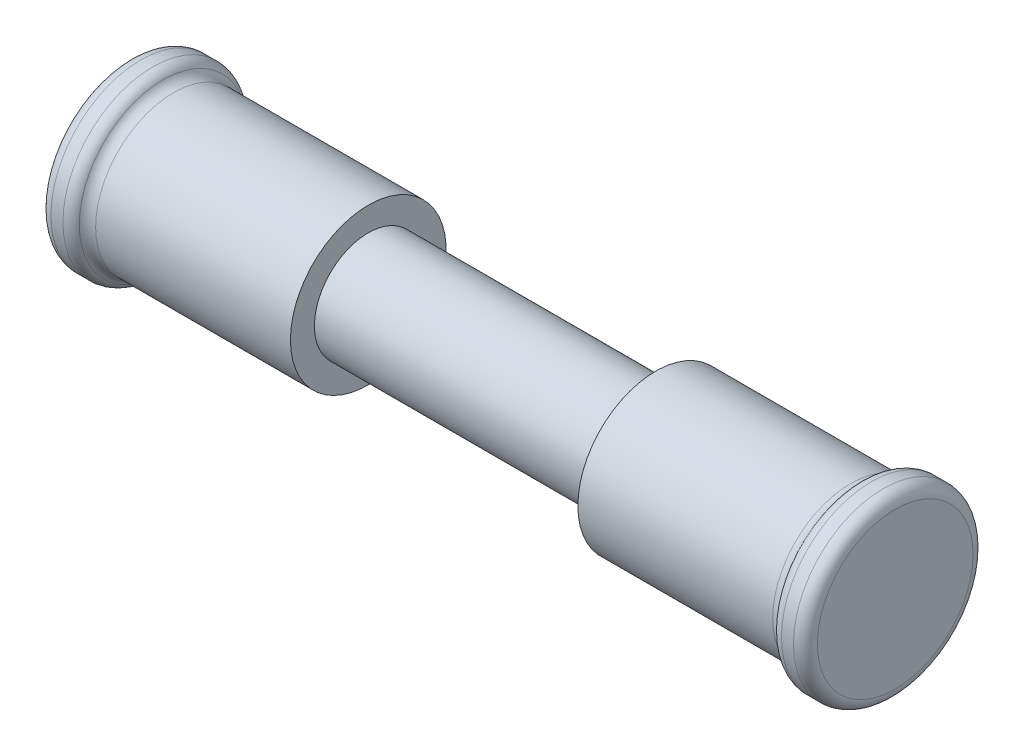
ISO-10303-21;
HEADER;
FILE_DESCRIPTION(('STEP AP214'),'2;1');
FILE_NAME('part.step','',(''),(''),'','','');
FILE_SCHEMA(('AUTOMOTIVE_DESIGN { 1 0 10303 214 1 1 1 1 }'));
ENDSEC;
DATA;
#1=APPLICATION_CONTEXT('core data for automotive mechanical design processes');
#2=APPLICATION_PROTOCOL_DEFINITION('international standard','automotive_design',2000,#1);
#3=PRODUCT_CONTEXT('',#1,'mechanical');
#4=PRODUCT('Part','Part','',(#3));
#5=PRODUCT_RELATED_PRODUCT_CATEGORY('part','',(#4));
#6=PRODUCT_DEFINITION_FORMATION('','',#4);
#7=PRODUCT_DEFINITION_CONTEXT('part definition',#1,'design');
#8=PRODUCT_DEFINITION('design','',#6,#7);
#9=PRODUCT_DEFINITION_SHAPE('','',#8);
#10=(LENGTH_UNIT() NAMED_UNIT(*) SI_UNIT(.MILLI.,.METRE.));
#11=(NAMED_UNIT(*) PLANE_ANGLE_UNIT() SI_UNIT($,.RADIAN.));
#12=(NAMED_UNIT(*) SI_UNIT($,.STERADIAN.) SOLID_ANGLE_UNIT());
#13=UNCERTAINTY_MEASURE_WITH_UNIT(LENGTH_MEASURE(1.E-05),#10,'distance_accuracy_value','');
#14=(GEOMETRIC_REPRESENTATION_CONTEXT(3) GLOBAL_UNCERTAINTY_ASSIGNED_CONTEXT((#13)) GLOBAL_UNIT_ASSIGNED_CONTEXT((#10,
#11,#12)) REPRESENTATION_CONTEXT('',''));
#15=CARTESIAN_POINT('',(0.,0.,0.));
#16=DIRECTION('',(0.,0.,1.));
#17=DIRECTION('',(1.,0.,0.));
#18=AXIS2_PLACEMENT_3D('',#15,#16,#17);
#19=CARTESIAN_POINT('',(16.,0.,0.));
#20=DIRECTION('',(-1.,0.,0.));
#21=DIRECTION('',(0.,0.,1.));
#22=AXIS2_PLACEMENT_3D('',#19,#20,#21);
#23=CYLINDRICAL_SURFACE('',#22,3.25);
#24=CARTESIAN_POINT('',(14.1339745962153,0.,0.));
#25=DIRECTION('',(-1.,0.,0.));
#26=DIRECTION('',(0.,0.,1.));
#27=AXIS2_PLACEMENT_3D('',#24,#25,#26);
#28=CIRCLE('',#27,3.25);
#29=CARTESIAN_POINT('',(14.1339745962153,0.,3.25));
#30=VERTEX_POINT('',#29);
#31=EDGE_CURVE('E37',#30,#30,#28,.T.);
#32=ORIENTED_EDGE('',*,*,#31,.T.);
#33=EDGE_LOOP('',(#32));
#34=FACE_BOUND('',#33,.T.);
#35=CARTESIAN_POINT('',(6.,0.,0.));
#36=DIRECTION('',(-1.,0.,0.));
#37=DIRECTION('',(0.,0.,1.));
#38=AXIS2_PLACEMENT_3D('',#35,#36,#37);
#39=CIRCLE('',#38,3.25);
#40=CARTESIAN_POINT('',(6.,0.,3.25));
#41=VERTEX_POINT('',#40);
#42=EDGE_CURVE('E77',#41,#41,#39,.T.);
#43=ORIENTED_EDGE('',*,*,#42,.F.);
#44=EDGE_LOOP('',(#43));
#45=FACE_BOUND('',#44,.T.);
#46=ADVANCED_FACE('F30',(#34,#45),#23,.T.);
#47=CARTESIAN_POINT('',(-16.,0.,0.));
#48=DIRECTION('',(1.,0.,0.));
#49=DIRECTION('',(0.,0.,-1.));
#50=AXIS2_PLACEMENT_3D('',#47,#48,#49);
#51=CYLINDRICAL_SURFACE('',#50,3.25);
#52=CARTESIAN_POINT('',(-14.1339745962153,0.,0.));
#53=DIRECTION('',(-1.,0.,0.));
#54=DIRECTION('',(0.,0.,1.));
#55=AXIS2_PLACEMENT_3D('',#52,#53,#54);
#56=CIRCLE('',#55,3.25);
#57=CARTESIAN_POINT('',(-14.1339745962153,0.,3.25));
#58=VERTEX_POINT('',#57);
#59=EDGE_CURVE('E53',#58,#58,#56,.F.);
#60=ORIENTED_EDGE('',*,*,#59,.T.);
#61=EDGE_LOOP('',(#60));
#62=FACE_BOUND('',#61,.T.);
#63=CARTESIAN_POINT('',(-6.,0.,0.));
#64=DIRECTION('',(-1.,0.,0.));
#65=DIRECTION('',(0.,0.,1.));
#66=AXIS2_PLACEMENT_3D('',#63,#64,#65);
#67=CIRCLE('',#66,3.25);
#68=CARTESIAN_POINT('',(-6.,0.,3.25));
#69=VERTEX_POINT('',#68);
#70=EDGE_CURVE('E72',#69,#69,#67,.T.);
#71=ORIENTED_EDGE('',*,*,#70,.T.);
#72=EDGE_LOOP('',(#71));
#73=FACE_BOUND('',#72,.T.);
#74=ADVANCED_FACE('F84',(#62,#73),#51,.T.);
#75=CARTESIAN_POINT('',(6.,0.,0.));
#76=DIRECTION('',(-1.,0.,0.));
#77=DIRECTION('',(0.,0.,1.));
#78=AXIS2_PLACEMENT_3D('',#75,#76,#77);
#79=CYLINDRICAL_SURFACE('',#78,2.25);
#80=CARTESIAN_POINT('',(6.,0.,0.));
#81=DIRECTION('',(1.,0.,0.));
#82=DIRECTION('',(0.,0.,-1.));
#83=AXIS2_PLACEMENT_3D('',#80,#81,#82);
#84=CIRCLE('',#83,2.25);
#85=CARTESIAN_POINT('',(6.,0.,-2.25));
#86=VERTEX_POINT('',#85);
#87=EDGE_CURVE('E68',#86,#86,#84,.T.);
#88=ORIENTED_EDGE('',*,*,#87,.F.);
#89=EDGE_LOOP('',(#88));
#90=FACE_BOUND('',#89,.T.);
#91=CARTESIAN_POINT('',(-6.,0.,0.));
#92=DIRECTION('',(1.,0.,0.));
#93=DIRECTION('',(0.,0.,-1.));
#94=AXIS2_PLACEMENT_3D('',#91,#92,#93);
#95=CIRCLE('',#94,2.25);
#96=CARTESIAN_POINT('',(-6.,0.,-2.25));
#97=VERTEX_POINT('',#96);
#98=EDGE_CURVE('E69',#97,#97,#95,.T.);
#99=ORIENTED_EDGE('',*,*,#98,.T.);
#100=EDGE_LOOP('',(#99));
#101=FACE_BOUND('',#100,.T.);
#102=ADVANCED_FACE('F89',(#90,#101),#79,.T.);
#103=CARTESIAN_POINT('',(-6.,0.,0.));
#104=DIRECTION('',(-1.,0.,0.));
#105=DIRECTION('',(0.,0.,1.));
#106=AXIS2_PLACEMENT_3D('',#103,#104,#105);
#107=PLANE('',#106);
#108=ORIENTED_EDGE('',*,*,#98,.F.);
#109=EDGE_LOOP('',(#108));
#110=FACE_BOUND('',#109,.T.);
#111=ORIENTED_EDGE('',*,*,#70,.F.);
#112=EDGE_LOOP('',(#111));
#113=FACE_BOUND('',#112,.T.);
#114=ADVANCED_FACE('F99',(#110,#113),#107,.F.);
#115=CARTESIAN_POINT('',(-14.5,0.,0.));
#116=DIRECTION('',(-1.,0.,0.));
#117=DIRECTION('',(0.,0.,1.));
#118=AXIS2_PLACEMENT_3D('',#115,#116,#117);
#119=CYLINDRICAL_SURFACE('',#118,3.75);
#120=CARTESIAN_POINT('',(-15.,0.,0.));
#121=DIRECTION('',(-1.,0.,0.));
#122=DIRECTION('',(0.,0.,1.));
#123=AXIS2_PLACEMENT_3D('',#120,#121,#122);
#124=CIRCLE('',#123,3.75);
#125=CARTESIAN_POINT('',(-15.,0.,3.75));
#126=VERTEX_POINT('',#125);
#127=EDGE_CURVE('E62',#126,#126,#124,.T.);
#128=ORIENTED_EDGE('',*,*,#127,.T.);
#129=EDGE_LOOP('',(#128));
#130=FACE_BOUND('',#129,.T.);
#131=CARTESIAN_POINT('',(-15.5,0.,0.));
#132=DIRECTION('',(-1.,0.,0.));
#133=DIRECTION('',(0.,0.,1.));
#134=AXIS2_PLACEMENT_3D('',#131,#132,#133);
#135=CIRCLE('',#134,3.75);
#136=CARTESIAN_POINT('',(-15.5,0.,3.75));
#137=VERTEX_POINT('',#136);
#138=EDGE_CURVE('E65',#137,#137,#135,.F.);
#139=ORIENTED_EDGE('',*,*,#138,.T.);
#140=EDGE_LOOP('',(#139));
#141=FACE_BOUND('',#140,.T.);
#142=ADVANCED_FACE('F95',(#130,#141),#119,.T.);
#143=CARTESIAN_POINT('',(-16.,0.,0.));
#144=DIRECTION('',(-1.,0.,0.));
#145=DIRECTION('',(0.,0.,1.));
#146=AXIS2_PLACEMENT_3D('',#143,#144,#145);
#147=PLANE('',#146);
#148=CARTESIAN_POINT('',(-16.,0.,0.));
#149=DIRECTION('',(-1.,0.,0.));
#150=DIRECTION('',(0.,0.,1.));
#151=AXIS2_PLACEMENT_3D('',#148,#149,#150);
#152=CIRCLE('',#151,3.25);
#153=CARTESIAN_POINT('',(-16.,0.,3.25));
#154=VERTEX_POINT('',#153);
#155=EDGE_CURVE('E59',#154,#154,#152,.T.);
#156=ORIENTED_EDGE('',*,*,#155,.T.);
#157=EDGE_LOOP('',(#156));
#158=FACE_BOUND('',#157,.T.);
#159=ADVANCED_FACE('F98',(#158),#147,.T.);
#160=CARTESIAN_POINT('',(-15.,0.,0.));
#161=DIRECTION('',(-1.,0.,0.));
#162=DIRECTION('',(0.,0.,1.));
#163=AXIS2_PLACEMENT_3D('',#160,#161,#162);
#164=TOROIDAL_SURFACE('',#163,3.25,0.5);
#165=CARTESIAN_POINT('',(-14.5669872981077,0.,0.));
#166=DIRECTION('',(-1.,0.,0.));
#167=DIRECTION('',(0.,0.,1.));
#168=AXIS2_PLACEMENT_3D('',#165,#166,#167);
#169=CIRCLE('',#168,3.49999999999992);
#170=CARTESIAN_POINT('',(-14.5669872981077,0.,3.49999999999992));
#171=VERTEX_POINT('',#170);
#172=EDGE_CURVE('E56',#171,#171,#169,.T.);
#173=ORIENTED_EDGE('',*,*,#172,.T.);
#174=EDGE_LOOP('',(#173));
#175=FACE_BOUND('',#174,.T.);
#176=ORIENTED_EDGE('',*,*,#127,.F.);
#177=EDGE_LOOP('',(#176));
#178=FACE_BOUND('',#177,.T.);
#179=ADVANCED_FACE('F103',(#175,#178),#164,.T.);
#180=CARTESIAN_POINT('',(-15.5,0.,0.));
#181=DIRECTION('',(-1.,0.,0.));
#182=DIRECTION('',(0.,0.,1.));
#183=AXIS2_PLACEMENT_3D('',#180,#181,#182);
#184=TOROIDAL_SURFACE('',#183,3.25,0.5);
#185=ORIENTED_EDGE('',*,*,#138,.F.);
#186=EDGE_LOOP('',(#185));
#187=FACE_BOUND('',#186,.T.);
#188=ORIENTED_EDGE('',*,*,#155,.F.);
#189=EDGE_LOOP('',(#188));
#190=FACE_BOUND('',#189,.T.);
#191=ADVANCED_FACE('F113',(#187,#190),#184,.T.);
#192=CARTESIAN_POINT('',(-14.1339745962153,0.,0.));
#193=DIRECTION('',(-1.,0.,0.));
#194=DIRECTION('',(0.,0.,1.));
#195=AXIS2_PLACEMENT_3D('',#192,#193,#194);
#196=TOROIDAL_SURFACE('',#195,3.74999999999992,0.5);
#197=ORIENTED_EDGE('',*,*,#59,.F.);
#198=EDGE_LOOP('',(#197));
#199=FACE_BOUND('',#198,.T.);
#200=ORIENTED_EDGE('',*,*,#172,.F.);
#201=EDGE_LOOP('',(#200));
#202=FACE_BOUND('',#201,.T.);
#203=ADVANCED_FACE('F117',(#199,#202),#196,.F.);
#204=CARTESIAN_POINT('',(6.,0.,0.));
#205=DIRECTION('',(1.,0.,0.));
#206=DIRECTION('',(0.,0.,1.));
#207=AXIS2_PLACEMENT_3D('',#204,#205,#206);
#208=PLANE('',#207);
#209=ORIENTED_EDGE('',*,*,#87,.T.);
#210=EDGE_LOOP('',(#209));
#211=FACE_BOUND('',#210,.T.);
#212=ORIENTED_EDGE('',*,*,#42,.T.);
#213=EDGE_LOOP('',(#212));
#214=FACE_BOUND('',#213,.T.);
#215=ADVANCED_FACE('F81',(#211,#214),#208,.F.);
#216=CARTESIAN_POINT('',(14.5,0.,0.));
#217=DIRECTION('',(1.,0.,0.));
#218=DIRECTION('',(0.,0.,-1.));
#219=AXIS2_PLACEMENT_3D('',#216,#217,#218);
#220=CYLINDRICAL_SURFACE('',#219,3.75);
#221=CARTESIAN_POINT('',(15.,0.,0.));
#222=DIRECTION('',(1.,0.,0.));
#223=DIRECTION('',(0.,0.,-1.));
#224=AXIS2_PLACEMENT_3D('',#221,#222,#223);
#225=CIRCLE('',#224,3.75);
#226=CARTESIAN_POINT('',(15.,0.,-3.75));
#227=VERTEX_POINT('',#226);
#228=EDGE_CURVE('E45',#227,#227,#225,.T.);
#229=ORIENTED_EDGE('',*,*,#228,.T.);
#230=EDGE_LOOP('',(#229));
#231=FACE_BOUND('',#230,.T.);
#232=CARTESIAN_POINT('',(15.5,0.,0.));
#233=DIRECTION('',(1.,0.,0.));
#234=DIRECTION('',(0.,0.,-1.));
#235=AXIS2_PLACEMENT_3D('',#232,#233,#234);
#236=CIRCLE('',#235,3.75);
#237=CARTESIAN_POINT('',(15.5,0.,-3.75));
#238=VERTEX_POINT('',#237);
#239=EDGE_CURVE('E50',#238,#238,#236,.F.);
#240=ORIENTED_EDGE('',*,*,#239,.T.);
#241=EDGE_LOOP('',(#240));
#242=FACE_BOUND('',#241,.T.);
#243=ADVANCED_FACE('F136',(#231,#242),#220,.T.);
#244=CARTESIAN_POINT('',(16.,0.,0.));
#245=DIRECTION('',(1.,0.,0.));
#246=DIRECTION('',(0.,0.,1.));
#247=AXIS2_PLACEMENT_3D('',#244,#245,#246);
#248=PLANE('',#247);
#249=CARTESIAN_POINT('',(16.,0.,0.));
#250=DIRECTION('',(1.,0.,0.));
#251=DIRECTION('',(0.,0.,-1.));
#252=AXIS2_PLACEMENT_3D('',#249,#250,#251);
#253=CIRCLE('',#252,3.25);
#254=CARTESIAN_POINT('',(16.,0.,-3.25));
#255=VERTEX_POINT('',#254);
#256=EDGE_CURVE('E41',#255,#255,#253,.T.);
#257=ORIENTED_EDGE('',*,*,#256,.T.);
#258=EDGE_LOOP('',(#257));
#259=FACE_BOUND('',#258,.T.);
#260=ADVANCED_FACE('F125',(#259),#248,.T.);
#261=CARTESIAN_POINT('',(15.,0.,0.));
#262=DIRECTION('',(1.,0.,0.));
#263=DIRECTION('',(0.,0.,-1.));
#264=AXIS2_PLACEMENT_3D('',#261,#262,#263);
#265=TOROIDAL_SURFACE('',#264,3.25,0.5);
#266=CARTESIAN_POINT('',(14.5669872981077,0.,0.));
#267=DIRECTION('',(1.,0.,0.));
#268=DIRECTION('',(0.,0.,-1.));
#269=AXIS2_PLACEMENT_3D('',#266,#267,#268);
#270=CIRCLE('',#269,3.49999999999992);
#271=CARTESIAN_POINT('',(14.5669872981077,0.,-3.49999999999992));
#272=VERTEX_POINT('',#271);
#273=EDGE_CURVE('E10',#272,#272,#270,.T.);
#274=ORIENTED_EDGE('',*,*,#273,.T.);
#275=EDGE_LOOP('',(#274));
#276=FACE_BOUND('',#275,.T.);
#277=ORIENTED_EDGE('',*,*,#228,.F.);
#278=EDGE_LOOP('',(#277));
#279=FACE_BOUND('',#278,.T.);
#280=ADVANCED_FACE('F122',(#276,#279),#265,.T.);
#281=CARTESIAN_POINT('',(15.5,0.,0.));
#282=DIRECTION('',(1.,0.,0.));
#283=DIRECTION('',(0.,0.,-1.));
#284=AXIS2_PLACEMENT_3D('',#281,#282,#283);
#285=TOROIDAL_SURFACE('',#284,3.25,0.5);
#286=ORIENTED_EDGE('',*,*,#256,.F.);
#287=EDGE_LOOP('',(#286));
#288=FACE_BOUND('',#287,.T.);
#289=ORIENTED_EDGE('',*,*,#239,.F.);
#290=EDGE_LOOP('',(#289));
#291=FACE_BOUND('',#290,.T.);
#292=ADVANCED_FACE('F124',(#288,#291),#285,.T.);
#293=CARTESIAN_POINT('',(14.1339745962153,0.,0.));
#294=DIRECTION('',(-1.,0.,0.));
#295=DIRECTION('',(0.,0.,1.));
#296=AXIS2_PLACEMENT_3D('',#293,#294,#295);
#297=TOROIDAL_SURFACE('',#296,3.74999999999992,0.5);
#298=ORIENTED_EDGE('',*,*,#273,.F.);
#299=EDGE_LOOP('',(#298));
#300=FACE_BOUND('',#299,.T.);
#301=ORIENTED_EDGE('',*,*,#31,.F.);
#302=EDGE_LOOP('',(#301));
#303=FACE_BOUND('',#302,.T.);
#304=ADVANCED_FACE('F32',(#300,#303),#297,.F.);
#305=CLOSED_SHELL('',(#46,#74,#102,#114,#142,#159,#179,#191,#203,#215,#243,#260,#280,#292,#304));
#306=MANIFOLD_SOLID_BREP('B2',#305);
#307=ADVANCED_BREP_SHAPE_REPRESENTATION('',(#18,#306),#14);
#308=SHAPE_DEFINITION_REPRESENTATION(#9,#307);
ENDSEC;
END-ISO-10303-21;
